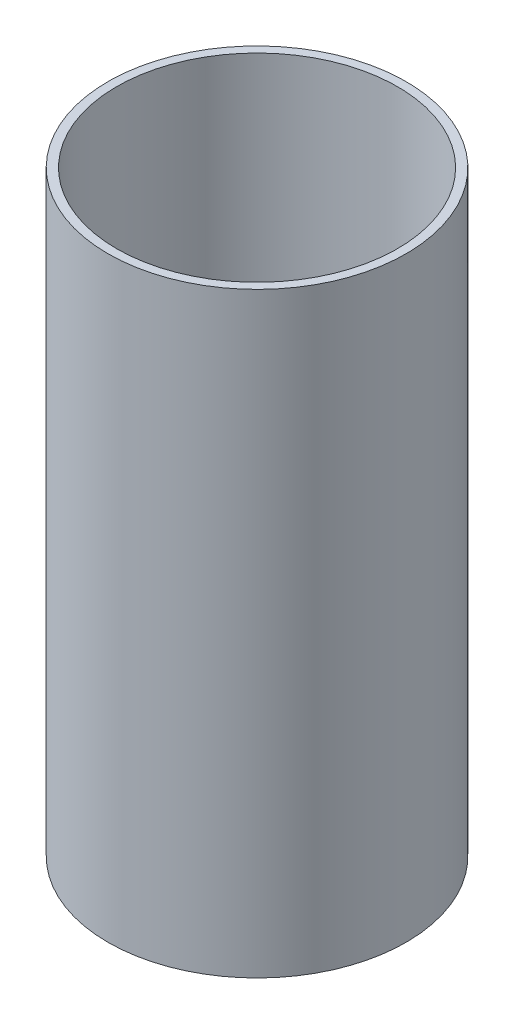
ISO-10303-21;
HEADER;
FILE_DESCRIPTION(('STEP AP214'),'2;1');
FILE_NAME('part.step','',(''),(''),'','','');
FILE_SCHEMA(('AUTOMOTIVE_DESIGN { 1 0 10303 214 1 1 1 1 }'));
ENDSEC;
DATA;
#1=APPLICATION_CONTEXT('core data for automotive mechanical design processes');
#2=APPLICATION_PROTOCOL_DEFINITION('international standard','automotive_design',2000,#1);
#3=PRODUCT_CONTEXT('',#1,'mechanical');
#4=PRODUCT('Part','Part','',(#3));
#5=PRODUCT_RELATED_PRODUCT_CATEGORY('part','',(#4));
#6=PRODUCT_DEFINITION_FORMATION('','',#4);
#7=PRODUCT_DEFINITION_CONTEXT('part definition',#1,'design');
#8=PRODUCT_DEFINITION('design','',#6,#7);
#9=PRODUCT_DEFINITION_SHAPE('','',#8);
#10=(LENGTH_UNIT() NAMED_UNIT(*) SI_UNIT(.MILLI.,.METRE.));
#11=(NAMED_UNIT(*) PLANE_ANGLE_UNIT() SI_UNIT($,.RADIAN.));
#12=(NAMED_UNIT(*) SI_UNIT($,.STERADIAN.) SOLID_ANGLE_UNIT());
#13=UNCERTAINTY_MEASURE_WITH_UNIT(LENGTH_MEASURE(1.E-05),#10,'distance_accuracy_value','');
#14=(GEOMETRIC_REPRESENTATION_CONTEXT(3) GLOBAL_UNCERTAINTY_ASSIGNED_CONTEXT((#13)) GLOBAL_UNIT_ASSIGNED_CONTEXT((#10,
#11,#12)) REPRESENTATION_CONTEXT('',''));
#15=CARTESIAN_POINT('',(0.,0.,0.));
#16=DIRECTION('',(0.,0.,1.));
#17=DIRECTION('',(1.,0.,0.));
#18=AXIS2_PLACEMENT_3D('',#15,#16,#17);
#19=CARTESIAN_POINT('',(0.,0.,0.));
#20=DIRECTION('',(0.,-1.,0.));
#21=DIRECTION('',(0.,0.,-1.));
#22=AXIS2_PLACEMENT_3D('',#19,#20,#21);
#23=CYLINDRICAL_SURFACE('',#22,6.35);
#24=CARTESIAN_POINT('',(0.,-25.4,0.));
#25=DIRECTION('',(0.,1.,0.));
#26=DIRECTION('',(0.,0.,1.));
#27=AXIS2_PLACEMENT_3D('',#24,#25,#26);
#28=CIRCLE('',#27,6.35);
#29=CARTESIAN_POINT('',(0.,-25.4,6.35));
#30=VERTEX_POINT('',#29);
#31=EDGE_CURVE('E51',#30,#30,#28,.T.);
#32=ORIENTED_EDGE('',*,*,#31,.T.);
#33=EDGE_LOOP('',(#32));
#34=FACE_BOUND('',#33,.T.);
#35=CARTESIAN_POINT('',(0.,0.,0.));
#36=DIRECTION('',(0.,1.,0.));
#37=DIRECTION('',(0.,0.,1.));
#38=AXIS2_PLACEMENT_3D('',#35,#36,#37);
#39=CIRCLE('',#38,6.35);
#40=CARTESIAN_POINT('',(0.,0.,6.35));
#41=VERTEX_POINT('',#40);
#42=EDGE_CURVE('E40',#41,#41,#39,.T.);
#43=ORIENTED_EDGE('',*,*,#42,.F.);
#44=EDGE_LOOP('',(#43));
#45=FACE_BOUND('',#44,.T.);
#46=ADVANCED_FACE('F37',(#34,#45),#23,.T.);
#47=CARTESIAN_POINT('',(0.,0.,0.));
#48=DIRECTION('',(0.,1.,0.));
#49=DIRECTION('',(0.,0.,1.));
#50=AXIS2_PLACEMENT_3D('',#47,#48,#49);
#51=PLANE('',#50);
#52=CARTESIAN_POINT('',(0.,0.,0.));
#53=DIRECTION('',(0.,1.,0.));
#54=DIRECTION('',(0.,0.,1.));
#55=AXIS2_PLACEMENT_3D('',#52,#53,#54);
#56=CIRCLE('',#55,5.9807608501618);
#57=CARTESIAN_POINT('',(0.,0.,5.9807608501618));
#58=VERTEX_POINT('',#57);
#59=EDGE_CURVE('E45',#58,#58,#56,.F.);
#60=ORIENTED_EDGE('',*,*,#59,.T.);
#61=EDGE_LOOP('',(#60));
#62=FACE_BOUND('',#61,.T.);
#63=ORIENTED_EDGE('',*,*,#42,.T.);
#64=EDGE_LOOP('',(#63));
#65=FACE_BOUND('',#64,.T.);
#66=ADVANCED_FACE('F61',(#62,#65),#51,.T.);
#67=CARTESIAN_POINT('',(0.,-25.4,0.));
#68=DIRECTION('',(0.,1.,0.));
#69=DIRECTION('',(0.,0.,1.));
#70=AXIS2_PLACEMENT_3D('',#67,#68,#69);
#71=PLANE('',#70);
#72=CARTESIAN_POINT('',(0.,-25.4,0.));
#73=DIRECTION('',(0.,1.,0.));
#74=DIRECTION('',(0.,0.,1.));
#75=AXIS2_PLACEMENT_3D('',#72,#73,#74);
#76=CIRCLE('',#75,5.9807608501618);
#77=CARTESIAN_POINT('',(0.,-25.4,5.9807608501618));
#78=VERTEX_POINT('',#77);
#79=EDGE_CURVE('E10',#78,#78,#76,.F.);
#80=ORIENTED_EDGE('',*,*,#79,.F.);
#81=EDGE_LOOP('',(#80));
#82=FACE_BOUND('',#81,.T.);
#83=ORIENTED_EDGE('',*,*,#31,.F.);
#84=EDGE_LOOP('',(#83));
#85=FACE_BOUND('',#84,.T.);
#86=ADVANCED_FACE('F67',(#82,#85),#71,.F.);
#87=CARTESIAN_POINT('',(0.,0.,0.));
#88=DIRECTION('',(0.,-1.,0.));
#89=DIRECTION('',(0.,0.,-1.));
#90=AXIS2_PLACEMENT_3D('',#87,#88,#89);
#91=CYLINDRICAL_SURFACE('',#90,5.9807608501618);
#92=ORIENTED_EDGE('',*,*,#79,.T.);
#93=EDGE_LOOP('',(#92));
#94=FACE_BOUND('',#93,.T.);
#95=ORIENTED_EDGE('',*,*,#59,.F.);
#96=EDGE_LOOP('',(#95));
#97=FACE_BOUND('',#96,.T.);
#98=ADVANCED_FACE('F69',(#94,#97),#91,.F.);
#99=CLOSED_SHELL('',(#46,#66,#86,#98));
#100=MANIFOLD_SOLID_BREP('B2',#99);
#101=ADVANCED_BREP_SHAPE_REPRESENTATION('',(#18,#100),#14);
#102=SHAPE_DEFINITION_REPRESENTATION(#9,#101);
ENDSEC;
END-ISO-10303-21;
